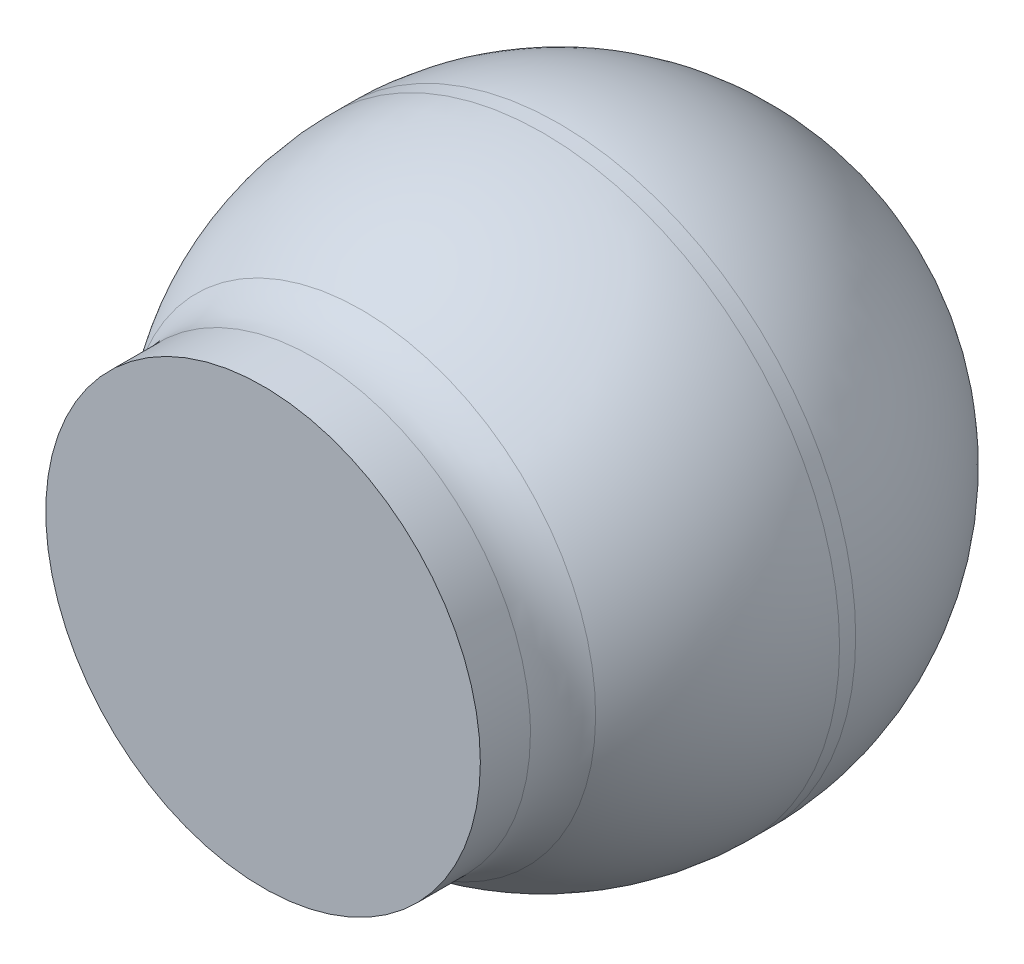
ISO-10303-21;
HEADER;
FILE_DESCRIPTION(('STEP AP214'),'2;1');
FILE_NAME('part.step','',(''),(''),'','','');
FILE_SCHEMA(('AUTOMOTIVE_DESIGN { 1 0 10303 214 1 1 1 1 }'));
ENDSEC;
DATA;
#1=APPLICATION_CONTEXT('core data for automotive mechanical design processes');
#2=APPLICATION_PROTOCOL_DEFINITION('international standard','automotive_design',2000,#1);
#3=PRODUCT_CONTEXT('',#1,'mechanical');
#4=PRODUCT('Part','Part','',(#3));
#5=PRODUCT_RELATED_PRODUCT_CATEGORY('part','',(#4));
#6=PRODUCT_DEFINITION_FORMATION('','',#4);
#7=PRODUCT_DEFINITION_CONTEXT('part definition',#1,'design');
#8=PRODUCT_DEFINITION('design','',#6,#7);
#9=PRODUCT_DEFINITION_SHAPE('','',#8);
#10=(LENGTH_UNIT() NAMED_UNIT(*) SI_UNIT(.MILLI.,.METRE.));
#11=(NAMED_UNIT(*) PLANE_ANGLE_UNIT() SI_UNIT($,.RADIAN.));
#12=(NAMED_UNIT(*) SI_UNIT($,.STERADIAN.) SOLID_ANGLE_UNIT());
#13=UNCERTAINTY_MEASURE_WITH_UNIT(LENGTH_MEASURE(1.E-05),#10,'distance_accuracy_value','');
#14=(GEOMETRIC_REPRESENTATION_CONTEXT(3) GLOBAL_UNCERTAINTY_ASSIGNED_CONTEXT((#13)) GLOBAL_UNIT_ASSIGNED_CONTEXT((#10,
#11,#12)) REPRESENTATION_CONTEXT('',''));
#15=CARTESIAN_POINT('',(0.,0.,0.));
#16=DIRECTION('',(0.,0.,1.));
#17=DIRECTION('',(1.,0.,0.));
#18=AXIS2_PLACEMENT_3D('',#15,#16,#17);
#19=CARTESIAN_POINT('',(-1.832919922269,-6.591349291452,10.006534503384));
#20=DIRECTION('',(0.,0.,-1.));
#21=DIRECTION('',(-1.,0.,0.));
#22=AXIS2_PLACEMENT_3D('',#19,#20,#21);
#23=PLANE('',#22);
#24=CARTESIAN_POINT('',(-1.832919922269,-6.591349291452,10.006534503384));
#25=DIRECTION('',(0.,0.,1.));
#26=DIRECTION('',(1.,0.,0.));
#27=AXIS2_PLACEMENT_3D('',#24,#25,#26);
#28=CIRCLE('',#27,0.275);
#29=CARTESIAN_POINT('',(-1.557919922269,-6.591349291452,10.006534503384));
#30=VERTEX_POINT('',#29);
#31=EDGE_CURVE('E20',#30,#30,#28,.F.);
#32=ORIENTED_EDGE('',*,*,#31,.F.);
#33=EDGE_LOOP('',(#32));
#34=FACE_BOUND('',#33,.T.);
#35=ADVANCED_FACE('F17',(#34),#23,.F.);
#36=CARTESIAN_POINT('',(-1.832919922269,-6.591349291452,9.906534503384));
#37=DIRECTION('',(0.,0.,1.));
#38=DIRECTION('',(1.,0.,0.));
#39=AXIS2_PLACEMENT_3D('',#36,#37,#38);
#40=CYLINDRICAL_SURFACE('',#39,0.275);
#41=CARTESIAN_POINT('',(-1.832919922269,-6.591349291452,9.943180457728));
#42=DIRECTION('',(0.,0.,-1.));
#43=DIRECTION('',(0.996700902337583,0.0811622527992438,0.));
#44=AXIS2_PLACEMENT_3D('',#41,#42,#43);
#45=CIRCLE('',#44,0.275);
#46=CARTESIAN_POINT('',(-1.55882717412616,-6.56902967193221,9.943180457728));
#47=VERTEX_POINT('',#46);
#48=EDGE_CURVE('E65',#47,#47,#45,.F.);
#49=ORIENTED_EDGE('',*,*,#48,.T.);
#50=EDGE_LOOP('',(#49));
#51=FACE_BOUND('',#50,.T.);
#52=ORIENTED_EDGE('',*,*,#31,.T.);
#53=EDGE_LOOP('',(#52));
#54=FACE_BOUND('',#53,.T.);
#55=ADVANCED_FACE('F62',(#51,#54),#40,.T.);
#56=CARTESIAN_POINT('',(-1.832919922269,-6.591349291452,9.943180457728));
#57=DIRECTION('',(0.,0.,-1.));
#58=DIRECTION('',(0.996700902337583,0.0811622527992448,0.));
#59=AXIS2_PLACEMENT_3D('',#56,#57,#58);
#60=TOROIDAL_SURFACE('',#59,0.375,0.1);
#61=ORIENTED_EDGE('',*,*,#48,.F.);
#62=EDGE_LOOP('',(#61));
#63=FACE_BOUND('',#62,.T.);
#64=CARTESIAN_POINT('',(-1.832919922269,-6.591349291452,9.881744931236));
#65=DIRECTION('',(0.,0.,-1.));
#66=DIRECTION('',(-0.996700902337598,-0.0811622527990593,0.));
#67=AXIS2_PLACEMENT_3D('',#64,#65,#66);
#68=CIRCLE('',#67,0.296097046412665);
#69=CARTESIAN_POINT('',(-2.128040115608,-6.615381194786,9.881744931236));
#70=VERTEX_POINT('',#69);
#71=EDGE_CURVE('E39',#70,#70,#68,.T.);
#72=ORIENTED_EDGE('',*,*,#71,.F.);
#73=EDGE_LOOP('',(#72));
#74=FACE_BOUND('',#73,.T.);
#75=ADVANCED_FACE('F57',(#63,#74),#60,.F.);
#76=CARTESIAN_POINT('',(-2.206682760645,-6.621785136252,9.651976062157));
#77=CARTESIAN_POINT('',(-2.206682760645,-6.621785136252,9.701461392103));
#78=CARTESIAN_POINT('',(-2.198526217348,-6.621120941579,9.750947004335));
#79=CARTESIAN_POINT('',(-2.182207085349,-6.619792059952,9.798626332798));
#80=CARTESIAN_POINT('',(-2.158341390838,-6.617848654938,9.842699544317));
#81=CARTESIAN_POINT('',(-2.128040115608,-6.615381194786,9.881744931236));
#82=(BOUNDED_CURVE() B_SPLINE_CURVE(5,(#76,#77,#78,#79,#80,#81),.UNSPECIFIED.,.F.,
.F.) B_SPLINE_CURVE_WITH_KNOTS((6,6),(0.,0.661568582165),
.UNSPECIFIED.) CURVE() GEOMETRIC_REPRESENTATION_ITEM() RATIONAL_B_SPLINE_CURVE((1.,1.,1.,1.,1.,1.)) REPRESENTATION_ITEM(''));
#83=CARTESIAN_POINT('',(-1.832919922269,-6.591349291452,9.651976062157));
#84=DIRECTION('',(0.,0.,-1.));
#85=AXIS1_PLACEMENT('',#83,#84);
#86=SURFACE_OF_REVOLUTION('',#82,#85);
#87=CARTESIAN_POINT('',(-1.832919922269,-6.591349291452,9.651976062157));
#88=DIRECTION('',(0.,0.,1.));
#89=DIRECTION('',(1.,0.,0.));
#90=AXIS2_PLACEMENT_3D('',#87,#88,#89);
#91=CIRCLE('',#90,0.375);
#92=CARTESIAN_POINT('',(-1.457919922269,-6.591349291452,9.651976062157));
#93=VERTEX_POINT('',#92);
#94=EDGE_CURVE('E36',#93,#93,#91,.F.);
#95=ORIENTED_EDGE('',*,*,#94,.F.);
#96=EDGE_LOOP('',(#95));
#97=FACE_BOUND('',#96,.T.);
#98=ORIENTED_EDGE('',*,*,#71,.T.);
#99=EDGE_LOOP('',(#98));
#100=FACE_BOUND('',#99,.T.);
#101=ADVANCED_FACE('F53',(#97,#100),#86,.F.);
#102=CARTESIAN_POINT('',(-1.832919922269,-6.591349291452,9.256534503384));
#103=DIRECTION('',(0.,0.,1.));
#104=DIRECTION('',(1.,0.,0.));
#105=AXIS2_PLACEMENT_3D('',#102,#103,#104);
#106=CYLINDRICAL_SURFACE('',#105,0.375);
#107=CARTESIAN_POINT('',(-1.832919922269,-6.591349291452,9.631534503384));
#108=DIRECTION('',(0.,0.,-1.));
#109=DIRECTION('',(0.0811622527992362,-0.996700902337583,0.));
#110=AXIS2_PLACEMENT_3D('',#107,#108,#109);
#111=CIRCLE('',#110,0.375);
#112=CARTESIAN_POINT('',(-1.80248407746929,-6.96511212982859,9.631534503384));
#113=VERTEX_POINT('',#112);
#114=CARTESIAN_POINT('',(-1.86335576706871,-6.21758645307541,9.631534503384));
#115=VERTEX_POINT('',#114);
#116=EDGE_CURVE('E11',#113,#115,#111,.T.);
#117=ORIENTED_EDGE('',*,*,#116,.F.);
#118=CARTESIAN_POINT('',(-1.832919922269,-6.591349291452,9.631534503384));
#119=DIRECTION('',(0.,0.,1.));
#120=DIRECTION('',(0.0811622527992359,-0.996700902337583,0.));
#121=AXIS2_PLACEMENT_3D('',#118,#119,#120);
#122=CIRCLE('',#121,0.375);
#123=EDGE_CURVE('E25',#115,#113,#122,.F.);
#124=ORIENTED_EDGE('',*,*,#123,.F.);
#125=EDGE_LOOP('',(#117,#124));
#126=FACE_BOUND('',#125,.T.);
#127=ORIENTED_EDGE('',*,*,#94,.T.);
#128=EDGE_LOOP('',(#127));
#129=FACE_BOUND('',#128,.T.);
#130=ADVANCED_FACE('F34',(#126,#129),#106,.T.);
#131=CARTESIAN_POINT('',(-1.832919922269,-6.591349291452,9.631534503384));
#132=DIRECTION('',(0.0811622527992361,-0.996700902337583,0.));
#133=DIRECTION('',(-0.996700902337583,-0.0811622527992361,0.));
#134=AXIS2_PLACEMENT_3D('',#131,#132,#133);
#135=SPHERICAL_SURFACE('',#134,0.375);
#136=ORIENTED_EDGE('',*,*,#123,.T.);
#137=ORIENTED_EDGE('',*,*,#116,.T.);
#138=EDGE_LOOP('',(#136,#137));
#139=FACE_BOUND('',#138,.T.);
#140=ADVANCED_FACE('F32',(#139),#135,.T.);
#141=CLOSED_SHELL('',(#35,#55,#75,#101,#130,#140));
#142=MANIFOLD_SOLID_BREP('B1',#141);
#143=ADVANCED_BREP_SHAPE_REPRESENTATION('',(#18,#142),#14);
#144=SHAPE_DEFINITION_REPRESENTATION(#9,#143);
ENDSEC;
END-ISO-10303-21;
